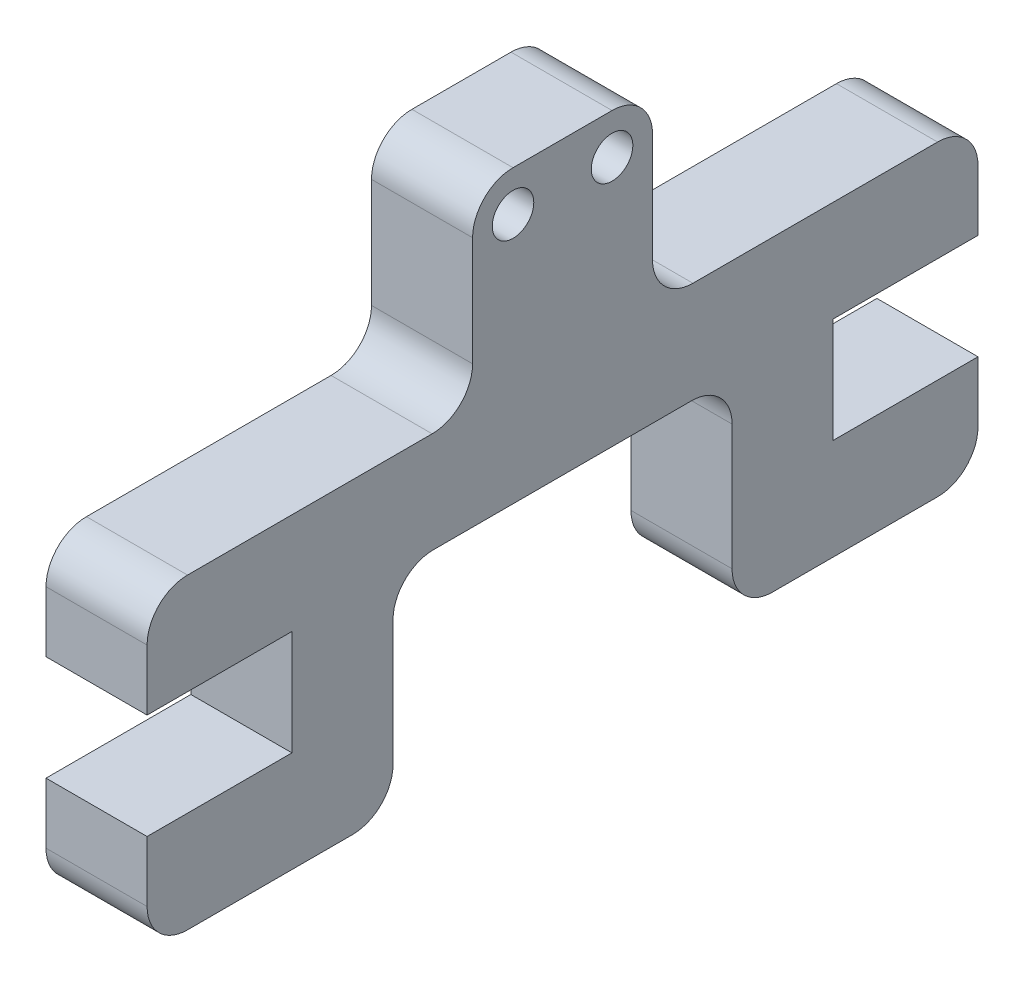
ISO-10303-21;
HEADER;
FILE_DESCRIPTION(('STEP AP214'),'2;1');
FILE_NAME('part.step','',(''),(''),'','','');
FILE_SCHEMA(('AUTOMOTIVE_DESIGN { 1 0 10303 214 1 1 1 1 }'));
ENDSEC;
DATA;
#1=APPLICATION_CONTEXT('core data for automotive mechanical design processes');
#2=APPLICATION_PROTOCOL_DEFINITION('international standard','automotive_design',2000,#1);
#3=PRODUCT_CONTEXT('',#1,'mechanical');
#4=PRODUCT('Part','Part','',(#3));
#5=PRODUCT_RELATED_PRODUCT_CATEGORY('part','',(#4));
#6=PRODUCT_DEFINITION_FORMATION('','',#4);
#7=PRODUCT_DEFINITION_CONTEXT('part definition',#1,'design');
#8=PRODUCT_DEFINITION('design','',#6,#7);
#9=PRODUCT_DEFINITION_SHAPE('','',#8);
#10=(LENGTH_UNIT() NAMED_UNIT(*) SI_UNIT(.MILLI.,.METRE.));
#11=(NAMED_UNIT(*) PLANE_ANGLE_UNIT() SI_UNIT($,.RADIAN.));
#12=(NAMED_UNIT(*) SI_UNIT($,.STERADIAN.) SOLID_ANGLE_UNIT());
#13=UNCERTAINTY_MEASURE_WITH_UNIT(LENGTH_MEASURE(1.E-05),#10,'distance_accuracy_value','');
#14=(GEOMETRIC_REPRESENTATION_CONTEXT(3) GLOBAL_UNCERTAINTY_ASSIGNED_CONTEXT((#13)) GLOBAL_UNIT_ASSIGNED_CONTEXT((#10,
#11,#12)) REPRESENTATION_CONTEXT('',''));
#15=CARTESIAN_POINT('',(0.,0.,0.));
#16=DIRECTION('',(0.,0.,1.));
#17=DIRECTION('',(1.,0.,0.));
#18=AXIS2_PLACEMENT_3D('',#15,#16,#17);
#19=CARTESIAN_POINT('',(10.,-28.8,32.2));
#20=DIRECTION('',(0.,1.,0.));
#21=DIRECTION('',(0.,0.,1.));
#22=AXIS2_PLACEMENT_3D('',#19,#20,#21);
#23=PLANE('',#22);
#24=DIRECTION('',(0.,0.,-1.));
#25=VECTOR('',#24,1.);
#26=CARTESIAN_POINT('',(0.,-28.8,32.2));
#27=LINE('',#26,#25);
#28=CARTESIAN_POINT('',(0.,-28.8,3.87));
#29=VERTEX_POINT('',#28);
#30=CARTESIAN_POINT('',(0.,-28.8,-21.67));
#31=VERTEX_POINT('',#30);
#32=EDGE_CURVE('E421',#29,#31,#27,.T.);
#33=ORIENTED_EDGE('',*,*,#32,.T.);
#34=DIRECTION('',(1.,0.,0.));
#35=VECTOR('',#34,1.);
#36=CARTESIAN_POINT('',(10.,-28.8,-21.67));
#37=LINE('',#36,#35);
#38=CARTESIAN_POINT('',(10.,-28.8,-21.67));
#39=VERTEX_POINT('',#38);
#40=EDGE_CURVE('E525',#31,#39,#37,.T.);
#41=ORIENTED_EDGE('',*,*,#40,.T.);
#42=DIRECTION('',(0.,0.,-1.));
#43=VECTOR('',#42,1.);
#44=CARTESIAN_POINT('',(10.,-28.8,32.2));
#45=LINE('',#44,#43);
#46=CARTESIAN_POINT('',(10.,-28.8,3.87));
#47=VERTEX_POINT('',#46);
#48=EDGE_CURVE('E391',#47,#39,#45,.T.);
#49=ORIENTED_EDGE('',*,*,#48,.F.);
#50=DIRECTION('',(1.,0.,0.));
#51=VECTOR('',#50,1.);
#52=CARTESIAN_POINT('',(10.,-28.8,3.87));
#53=LINE('',#52,#51);
#54=EDGE_CURVE('E522',#47,#29,#53,.F.);
#55=ORIENTED_EDGE('',*,*,#54,.T.);
#56=EDGE_LOOP('',(#33,#41,#49,#55));
#57=FACE_BOUND('',#56,.T.);
#58=ADVANCED_FACE('F38',(#57),#23,.F.);
#59=CARTESIAN_POINT('',(10.,-28.8,-35.67));
#60=VERTEX_POINT('',#59);
#61=CARTESIAN_POINT('',(10.,-28.8,-50.));
#62=VERTEX_POINT('',#61);
#63=EDGE_CURVE('E385',#60,#62,#45,.T.);
#64=ORIENTED_EDGE('',*,*,#63,.F.);
#65=DIRECTION('',(1.,0.,0.));
#66=VECTOR('',#65,1.);
#67=CARTESIAN_POINT('',(-31.7507307002532,-28.8,-35.67));
#68=LINE('',#67,#66);
#69=CARTESIAN_POINT('',(0.,-28.8,-35.67));
#70=VERTEX_POINT('',#69);
#71=EDGE_CURVE('E265',#70,#60,#68,.T.);
#72=ORIENTED_EDGE('',*,*,#71,.F.);
#73=CARTESIAN_POINT('',(0.,-28.8,-50.));
#74=VERTEX_POINT('',#73);
#75=EDGE_CURVE('E415',#70,#74,#27,.T.);
#76=ORIENTED_EDGE('',*,*,#75,.T.);
#77=DIRECTION('',(-1.,0.,0.));
#78=VECTOR('',#77,1.);
#79=CARTESIAN_POINT('',(10.,-28.8,-50.));
#80=LINE('',#79,#78);
#81=EDGE_CURVE('E406',#62,#74,#80,.T.);
#82=ORIENTED_EDGE('',*,*,#81,.F.);
#83=EDGE_LOOP('',(#64,#72,#76,#82));
#84=FACE_BOUND('',#83,.T.);
#85=ADVANCED_FACE('F601',(#84),#23,.F.);
#86=CARTESIAN_POINT('',(10.,0.,0.));
#87=DIRECTION('',(0.,0.,-1.));
#88=DIRECTION('',(0.,1.,0.));
#89=AXIS2_PLACEMENT_3D('',#86,#87,#88);
#90=PLANE('',#89);
#91=DIRECTION('',(0.,-1.,0.));
#92=VECTOR('',#91,1.);
#93=CARTESIAN_POINT('',(0.,0.,0.));
#94=LINE('',#93,#92);
#95=CARTESIAN_POINT('',(0.,-4.,0.));
#96=VERTEX_POINT('',#95);
#97=CARTESIAN_POINT('',(0.,-14.8,0.));
#98=VERTEX_POINT('',#97);
#99=EDGE_CURVE('E361',#96,#98,#94,.T.);
#100=ORIENTED_EDGE('',*,*,#99,.T.);
#101=DIRECTION('',(-1.,0.,0.));
#102=VECTOR('',#101,1.);
#103=CARTESIAN_POINT('',(10.,-14.8,0.));
#104=LINE('',#103,#102);
#105=CARTESIAN_POINT('',(10.,-14.8,0.));
#106=VERTEX_POINT('',#105);
#107=EDGE_CURVE('E572',#98,#106,#104,.F.);
#108=ORIENTED_EDGE('',*,*,#107,.T.);
#109=DIRECTION('',(0.,-1.,0.));
#110=VECTOR('',#109,1.);
#111=CARTESIAN_POINT('',(10.,0.,0.));
#112=LINE('',#111,#110);
#113=CARTESIAN_POINT('',(10.,-4.,0.));
#114=VERTEX_POINT('',#113);
#115=EDGE_CURVE('E373',#114,#106,#112,.T.);
#116=ORIENTED_EDGE('',*,*,#115,.F.);
#117=DIRECTION('',(-1.,0.,0.));
#118=VECTOR('',#117,1.);
#119=CARTESIAN_POINT('',(10.,-4.,0.));
#120=LINE('',#119,#118);
#121=EDGE_CURVE('E466',#114,#96,#120,.T.);
#122=ORIENTED_EDGE('',*,*,#121,.T.);
#123=EDGE_LOOP('',(#100,#108,#116,#122));
#124=FACE_BOUND('',#123,.T.);
#125=ADVANCED_FACE('F643',(#124),#90,.F.);
#126=CARTESIAN_POINT('',(10.,-18.8,0.));
#127=DIRECTION('',(0.,-1.,0.));
#128=DIRECTION('',(0.,0.,-1.));
#129=AXIS2_PLACEMENT_3D('',#126,#127,#128);
#130=PLANE('',#129);
#131=DIRECTION('',(0.,0.,1.));
#132=VECTOR('',#131,1.);
#133=CARTESIAN_POINT('',(0.,-18.8,0.));
#134=LINE('',#133,#132);
#135=CARTESIAN_POINT('',(0.,-18.8,4.));
#136=VERTEX_POINT('',#135);
#137=CARTESIAN_POINT('',(0.,-18.8,28.2));
#138=VERTEX_POINT('',#137);
#139=EDGE_CURVE('E409',#136,#138,#134,.T.);
#140=ORIENTED_EDGE('',*,*,#139,.T.);
#141=DIRECTION('',(-1.,0.,0.));
#142=VECTOR('',#141,1.);
#143=CARTESIAN_POINT('',(10.,-18.8,28.2));
#144=LINE('',#143,#142);
#145=CARTESIAN_POINT('',(10.,-18.8,28.2));
#146=VERTEX_POINT('',#145);
#147=EDGE_CURVE('E565',#138,#146,#144,.F.);
#148=ORIENTED_EDGE('',*,*,#147,.T.);
#149=DIRECTION('',(0.,0.,1.));
#150=VECTOR('',#149,1.);
#151=CARTESIAN_POINT('',(10.,-18.8,0.));
#152=LINE('',#151,#150);
#153=CARTESIAN_POINT('',(10.,-18.8,4.));
#154=VERTEX_POINT('',#153);
#155=EDGE_CURVE('E377',#154,#146,#152,.T.);
#156=ORIENTED_EDGE('',*,*,#155,.F.);
#157=DIRECTION('',(-1.,0.,0.));
#158=VECTOR('',#157,1.);
#159=CARTESIAN_POINT('',(0.,-18.8,4.));
#160=LINE('',#159,#158);
#161=EDGE_CURVE('E561',#154,#136,#160,.T.);
#162=ORIENTED_EDGE('',*,*,#161,.T.);
#163=EDGE_LOOP('',(#140,#148,#156,#162));
#164=FACE_BOUND('',#163,.T.);
#165=ADVANCED_FACE('F650',(#164),#130,.F.);
#166=CARTESIAN_POINT('',(10.,-18.8,32.2));
#167=DIRECTION('',(0.,0.,-1.));
#168=DIRECTION('',(-1.,0.,0.));
#169=AXIS2_PLACEMENT_3D('',#166,#167,#168);
#170=PLANE('',#169);
#171=DIRECTION('',(0.,-1.,0.));
#172=VECTOR('',#171,1.);
#173=CARTESIAN_POINT('',(10.,-18.8,32.2));
#174=LINE('',#173,#172);
#175=CARTESIAN_POINT('',(10.,-22.8,32.2));
#176=VERTEX_POINT('',#175);
#177=CARTESIAN_POINT('',(10.,-28.8,32.2));
#178=VERTEX_POINT('',#177);
#179=EDGE_CURVE('E382',#176,#178,#174,.T.);
#180=ORIENTED_EDGE('',*,*,#179,.F.);
#181=DIRECTION('',(-1.,0.,0.));
#182=VECTOR('',#181,1.);
#183=CARTESIAN_POINT('',(10.,-22.8,32.2));
#184=LINE('',#183,#182);
#185=CARTESIAN_POINT('',(0.,-22.8,32.2));
#186=VERTEX_POINT('',#185);
#187=EDGE_CURVE('E557',#176,#186,#184,.T.);
#188=ORIENTED_EDGE('',*,*,#187,.T.);
#189=DIRECTION('',(0.,-1.,0.));
#190=VECTOR('',#189,1.);
#191=CARTESIAN_POINT('',(0.,-18.8,32.2));
#192=LINE('',#191,#190);
#193=CARTESIAN_POINT('',(0.,-28.8,32.2));
#194=VERTEX_POINT('',#193);
#195=EDGE_CURVE('E412',#186,#194,#192,.T.);
#196=ORIENTED_EDGE('',*,*,#195,.T.);
#197=DIRECTION('',(-1.,0.,0.));
#198=VECTOR('',#197,1.);
#199=CARTESIAN_POINT('',(10.,-28.8,32.2));
#200=LINE('',#199,#198);
#201=EDGE_CURVE('E438',#178,#194,#200,.T.);
#202=ORIENTED_EDGE('',*,*,#201,.F.);
#203=EDGE_LOOP('',(#180,#188,#196,#202));
#204=FACE_BOUND('',#203,.T.);
#205=ADVANCED_FACE('F658',(#204),#170,.F.);
#206=CARTESIAN_POINT('',(0.,-28.8,17.87));
#207=VERTEX_POINT('',#206);
#208=EDGE_CURVE('E416',#194,#207,#27,.T.);
#209=ORIENTED_EDGE('',*,*,#208,.T.);
#210=DIRECTION('',(1.,0.,0.));
#211=VECTOR('',#210,1.);
#212=CARTESIAN_POINT('',(-31.7507307002532,-28.8,17.87));
#213=LINE('',#212,#211);
#214=CARTESIAN_POINT('',(10.,-28.8,17.87));
#215=VERTEX_POINT('',#214);
#216=EDGE_CURVE('E335',#207,#215,#213,.T.);
#217=ORIENTED_EDGE('',*,*,#216,.T.);
#218=EDGE_CURVE('E386',#178,#215,#45,.T.);
#219=ORIENTED_EDGE('',*,*,#218,.F.);
#220=ORIENTED_EDGE('',*,*,#201,.T.);
#221=EDGE_LOOP('',(#209,#217,#219,#220));
#222=FACE_BOUND('',#221,.T.);
#223=ADVANCED_FACE('F662',(#222),#23,.F.);
#224=CARTESIAN_POINT('',(10.,-28.8,-50.));
#225=DIRECTION('',(0.,0.,1.));
#226=DIRECTION('',(1.,0.,0.));
#227=AXIS2_PLACEMENT_3D('',#224,#225,#226);
#228=PLANE('',#227);
#229=DIRECTION('',(0.,1.,0.));
#230=VECTOR('',#229,1.);
#231=CARTESIAN_POINT('',(0.,-28.8,-50.));
#232=LINE('',#231,#230);
#233=CARTESIAN_POINT('',(0.,-22.8,-50.));
#234=VERTEX_POINT('',#233);
#235=EDGE_CURVE('E420',#74,#234,#232,.T.);
#236=ORIENTED_EDGE('',*,*,#235,.T.);
#237=DIRECTION('',(-1.,0.,0.));
#238=VECTOR('',#237,1.);
#239=CARTESIAN_POINT('',(10.,-22.8,-50.));
#240=LINE('',#239,#238);
#241=CARTESIAN_POINT('',(10.,-22.8,-50.));
#242=VERTEX_POINT('',#241);
#243=EDGE_CURVE('E554',#234,#242,#240,.F.);
#244=ORIENTED_EDGE('',*,*,#243,.T.);
#245=DIRECTION('',(0.,1.,0.));
#246=VECTOR('',#245,1.);
#247=CARTESIAN_POINT('',(10.,-28.8,-50.));
#248=LINE('',#247,#246);
#249=EDGE_CURVE('E390',#62,#242,#248,.T.);
#250=ORIENTED_EDGE('',*,*,#249,.F.);
#251=ORIENTED_EDGE('',*,*,#81,.T.);
#252=EDGE_LOOP('',(#236,#244,#250,#251));
#253=FACE_BOUND('',#252,.T.);
#254=ADVANCED_FACE('F605',(#253),#228,.F.);
#255=CARTESIAN_POINT('',(10.,-18.8,-17.8));
#256=DIRECTION('',(0.,-1.,0.));
#257=DIRECTION('',(0.,0.,-1.));
#258=AXIS2_PLACEMENT_3D('',#255,#256,#257);
#259=PLANE('',#258);
#260=DIRECTION('',(0.,0.,1.));
#261=VECTOR('',#260,1.);
#262=CARTESIAN_POINT('',(10.,-18.8,-17.8));
#263=LINE('',#262,#261);
#264=CARTESIAN_POINT('',(10.,-18.8,-46.));
#265=VERTEX_POINT('',#264);
#266=CARTESIAN_POINT('',(10.,-18.8,-21.8));
#267=VERTEX_POINT('',#266);
#268=EDGE_CURVE('E395',#265,#267,#263,.T.);
#269=ORIENTED_EDGE('',*,*,#268,.F.);
#270=DIRECTION('',(-1.,0.,0.));
#271=VECTOR('',#270,1.);
#272=CARTESIAN_POINT('',(10.,-18.8,-46.));
#273=LINE('',#272,#271);
#274=CARTESIAN_POINT('',(0.,-18.8,-46.));
#275=VERTEX_POINT('',#274);
#276=EDGE_CURVE('E550',#265,#275,#273,.T.);
#277=ORIENTED_EDGE('',*,*,#276,.T.);
#278=DIRECTION('',(0.,0.,1.));
#279=VECTOR('',#278,1.);
#280=CARTESIAN_POINT('',(0.,-18.8,-17.8));
#281=LINE('',#280,#279);
#282=CARTESIAN_POINT('',(0.,-18.8,-21.8));
#283=VERTEX_POINT('',#282);
#284=EDGE_CURVE('E425',#275,#283,#281,.T.);
#285=ORIENTED_EDGE('',*,*,#284,.T.);
#286=DIRECTION('',(-1.,0.,0.));
#287=VECTOR('',#286,1.);
#288=CARTESIAN_POINT('',(10.,-18.8,-21.8));
#289=LINE('',#288,#287);
#290=EDGE_CURVE('E547',#283,#267,#289,.F.);
#291=ORIENTED_EDGE('',*,*,#290,.T.);
#292=EDGE_LOOP('',(#269,#277,#285,#291));
#293=FACE_BOUND('',#292,.T.);
#294=ADVANCED_FACE('F616',(#293),#259,.F.);
#295=CARTESIAN_POINT('',(10.,0.,-17.8));
#296=DIRECTION('',(0.,0.,1.));
#297=DIRECTION('',(0.,-1.,0.));
#298=AXIS2_PLACEMENT_3D('',#295,#296,#297);
#299=PLANE('',#298);
#300=DIRECTION('',(0.,1.,0.));
#301=VECTOR('',#300,1.);
#302=CARTESIAN_POINT('',(10.,0.,-17.8));
#303=LINE('',#302,#301);
#304=CARTESIAN_POINT('',(10.,-14.8,-17.8));
#305=VERTEX_POINT('',#304);
#306=CARTESIAN_POINT('',(10.,-4.,-17.8));
#307=VERTEX_POINT('',#306);
#308=EDGE_CURVE('E399',#305,#307,#303,.T.);
#309=ORIENTED_EDGE('',*,*,#308,.F.);
#310=DIRECTION('',(-1.,0.,0.));
#311=VECTOR('',#310,1.);
#312=CARTESIAN_POINT('',(0.,-14.8,-17.8));
#313=LINE('',#312,#311);
#314=CARTESIAN_POINT('',(0.,-14.8,-17.8));
#315=VERTEX_POINT('',#314);
#316=EDGE_CURVE('E568',#305,#315,#313,.T.);
#317=ORIENTED_EDGE('',*,*,#316,.T.);
#318=DIRECTION('',(0.,1.,0.));
#319=VECTOR('',#318,1.);
#320=CARTESIAN_POINT('',(0.,0.,-17.8));
#321=LINE('',#320,#319);
#322=CARTESIAN_POINT('',(0.,-4.,-17.8));
#323=VERTEX_POINT('',#322);
#324=EDGE_CURVE('E429',#315,#323,#321,.T.);
#325=ORIENTED_EDGE('',*,*,#324,.T.);
#326=DIRECTION('',(-1.,0.,0.));
#327=VECTOR('',#326,1.);
#328=CARTESIAN_POINT('',(10.,-4.,-17.8));
#329=LINE('',#328,#327);
#330=EDGE_CURVE('E456',#323,#307,#329,.F.);
#331=ORIENTED_EDGE('',*,*,#330,.T.);
#332=EDGE_LOOP('',(#309,#317,#325,#331));
#333=FACE_BOUND('',#332,.T.);
#334=ADVANCED_FACE('F625',(#333),#299,.F.);
#335=CARTESIAN_POINT('',(10.,0.,0.));
#336=DIRECTION('',(0.,-1.,0.));
#337=DIRECTION('',(0.,0.,-1.));
#338=AXIS2_PLACEMENT_3D('',#335,#336,#337);
#339=PLANE('',#338);
#340=DIRECTION('',(0.,0.,1.));
#341=VECTOR('',#340,1.);
#342=CARTESIAN_POINT('',(10.,0.,0.));
#343=LINE('',#342,#341);
#344=CARTESIAN_POINT('',(10.,0.,-13.8));
#345=VERTEX_POINT('',#344);
#346=CARTESIAN_POINT('',(10.,0.,-4.));
#347=VERTEX_POINT('',#346);
#348=EDGE_CURVE('E402',#345,#347,#343,.T.);
#349=ORIENTED_EDGE('',*,*,#348,.F.);
#350=DIRECTION('',(-1.,0.,0.));
#351=VECTOR('',#350,1.);
#352=CARTESIAN_POINT('',(10.,0.,-13.8));
#353=LINE('',#352,#351);
#354=CARTESIAN_POINT('',(0.,0.,-13.8));
#355=VERTEX_POINT('',#354);
#356=EDGE_CURVE('E445',#345,#355,#353,.T.);
#357=ORIENTED_EDGE('',*,*,#356,.T.);
#358=DIRECTION('',(0.,0.,1.));
#359=VECTOR('',#358,1.);
#360=CARTESIAN_POINT('',(0.,0.,0.));
#361=LINE('',#360,#359);
#362=CARTESIAN_POINT('',(0.,0.,-4.));
#363=VERTEX_POINT('',#362);
#364=EDGE_CURVE('E378',#355,#363,#361,.T.);
#365=ORIENTED_EDGE('',*,*,#364,.T.);
#366=DIRECTION('',(-1.,0.,0.));
#367=VECTOR('',#366,1.);
#368=CARTESIAN_POINT('',(10.,0.,-4.));
#369=LINE('',#368,#367);
#370=EDGE_CURVE('E442',#363,#347,#369,.F.);
#371=ORIENTED_EDGE('',*,*,#370,.T.);
#372=EDGE_LOOP('',(#349,#357,#365,#371));
#373=FACE_BOUND('',#372,.T.);
#374=ADVANCED_FACE('F635',(#373),#339,.F.);
#375=CARTESIAN_POINT('',(10.,0.,0.));
#376=DIRECTION('',(-1.,0.,0.));
#377=DIRECTION('',(0.,0.,1.));
#378=AXIS2_PLACEMENT_3D('',#375,#376,#377);
#379=PLANE('',#378);
#380=CARTESIAN_POINT('',(10.,-4.,-4.));
#381=DIRECTION('',(1.,0.,0.));
#382=DIRECTION('',(0.,0.,-1.));
#383=AXIS2_PLACEMENT_3D('',#380,#381,#382);
#384=CIRCLE('',#383,2.055);
#385=CARTESIAN_POINT('',(10.,-4.,-6.055));
#386=VERTEX_POINT('',#385);
#387=EDGE_CURVE('E362',#386,#386,#384,.T.);
#388=ORIENTED_EDGE('',*,*,#387,.F.);
#389=EDGE_LOOP('',(#388));
#390=FACE_BOUND('',#389,.T.);
#391=CARTESIAN_POINT('',(10.,-4.,-13.8));
#392=DIRECTION('',(1.,0.,0.));
#393=DIRECTION('',(0.,0.,-1.));
#394=AXIS2_PLACEMENT_3D('',#391,#392,#393);
#395=CIRCLE('',#394,2.055);
#396=CARTESIAN_POINT('',(10.,-4.,-15.855));
#397=VERTEX_POINT('',#396);
#398=EDGE_CURVE('E356',#397,#397,#395,.T.);
#399=ORIENTED_EDGE('',*,*,#398,.F.);
#400=EDGE_LOOP('',(#399));
#401=FACE_BOUND('',#400,.T.);
#402=DIRECTION('',(0.,0.,-1.));
#403=VECTOR('',#402,1.);
#404=CARTESIAN_POINT('',(10.,-49.2,-50.));
#405=LINE('',#404,#403);
#406=CARTESIAN_POINT('',(10.,-49.2,-29.67));
#407=VERTEX_POINT('',#406);
#408=CARTESIAN_POINT('',(10.,-49.2,-46.));
#409=VERTEX_POINT('',#408);
#410=EDGE_CURVE('E283',#407,#409,#405,.T.);
#411=ORIENTED_EDGE('',*,*,#410,.T.);
#412=CARTESIAN_POINT('',(10.,-45.2,-46.));
#413=DIRECTION('',(-1.,0.,0.));
#414=DIRECTION('',(0.,0.,1.));
#415=AXIS2_PLACEMENT_3D('',#412,#413,#414);
#416=CIRCLE('',#415,4.);
#417=CARTESIAN_POINT('',(10.,-45.2,-50.));
#418=VERTEX_POINT('',#417);
#419=EDGE_CURVE('E492',#409,#418,#416,.F.);
#420=ORIENTED_EDGE('',*,*,#419,.T.);
#421=DIRECTION('',(0.,1.,0.));
#422=VECTOR('',#421,1.);
#423=CARTESIAN_POINT('',(10.,-39.2,-50.));
#424=LINE('',#423,#422);
#425=CARTESIAN_POINT('',(10.,-39.2,-50.));
#426=VERTEX_POINT('',#425);
#427=EDGE_CURVE('E273',#418,#426,#424,.T.);
#428=ORIENTED_EDGE('',*,*,#427,.T.);
#429=DIRECTION('',(0.,0.,1.));
#430=VECTOR('',#429,1.);
#431=CARTESIAN_POINT('',(10.,-39.2,-35.67));
#432=LINE('',#431,#430);
#433=CARTESIAN_POINT('',(10.,-39.2,-35.67));
#434=VERTEX_POINT('',#433);
#435=EDGE_CURVE('E252',#426,#434,#432,.T.);
#436=ORIENTED_EDGE('',*,*,#435,.T.);
#437=DIRECTION('',(0.,1.,0.));
#438=VECTOR('',#437,1.);
#439=CARTESIAN_POINT('',(10.,-28.8,-35.67));
#440=LINE('',#439,#438);
#441=EDGE_CURVE('E262',#434,#60,#440,.T.);
#442=ORIENTED_EDGE('',*,*,#441,.T.);
#443=ORIENTED_EDGE('',*,*,#63,.T.);
#444=ORIENTED_EDGE('',*,*,#249,.T.);
#445=CARTESIAN_POINT('',(10.,-22.8,-46.));
#446=DIRECTION('',(-1.,0.,0.));
#447=DIRECTION('',(0.,0.,1.));
#448=AXIS2_PLACEMENT_3D('',#445,#446,#447);
#449=CIRCLE('',#448,4.);
#450=EDGE_CURVE('E480',#242,#265,#449,.F.);
#451=ORIENTED_EDGE('',*,*,#450,.T.);
#452=ORIENTED_EDGE('',*,*,#268,.T.);
#453=CARTESIAN_POINT('',(10.,-14.8,-21.8));
#454=DIRECTION('',(-1.,0.,0.));
#455=DIRECTION('',(0.,0.,1.));
#456=AXIS2_PLACEMENT_3D('',#453,#454,#455);
#457=CIRCLE('',#456,4.);
#458=EDGE_CURVE('E590',#267,#305,#457,.T.);
#459=ORIENTED_EDGE('',*,*,#458,.T.);
#460=ORIENTED_EDGE('',*,*,#308,.T.);
#461=CARTESIAN_POINT('',(10.,-4.,-13.8));
#462=DIRECTION('',(-1.,0.,0.));
#463=DIRECTION('',(0.,0.,1.));
#464=AXIS2_PLACEMENT_3D('',#461,#462,#463);
#465=CIRCLE('',#464,4.);
#466=EDGE_CURVE('E463',#307,#345,#465,.F.);
#467=ORIENTED_EDGE('',*,*,#466,.T.);
#468=ORIENTED_EDGE('',*,*,#348,.T.);
#469=CARTESIAN_POINT('',(10.,-4.,-4.));
#470=DIRECTION('',(-1.,0.,0.));
#471=DIRECTION('',(0.,0.,1.));
#472=AXIS2_PLACEMENT_3D('',#469,#470,#471);
#473=CIRCLE('',#472,4.);
#474=EDGE_CURVE('E460',#347,#114,#473,.F.);
#475=ORIENTED_EDGE('',*,*,#474,.T.);
#476=ORIENTED_EDGE('',*,*,#115,.T.);
#477=CARTESIAN_POINT('',(10.,-14.8,4.));
#478=DIRECTION('',(-1.,0.,0.));
#479=DIRECTION('',(0.,0.,1.));
#480=AXIS2_PLACEMENT_3D('',#477,#478,#479);
#481=CIRCLE('',#480,4.);
#482=EDGE_CURVE('E11',#106,#154,#481,.T.);
#483=ORIENTED_EDGE('',*,*,#482,.T.);
#484=ORIENTED_EDGE('',*,*,#155,.T.);
#485=CARTESIAN_POINT('',(10.,-22.8,28.2));
#486=DIRECTION('',(-1.,0.,0.));
#487=DIRECTION('',(0.,0.,1.));
#488=AXIS2_PLACEMENT_3D('',#485,#486,#487);
#489=CIRCLE('',#488,4.);
#490=EDGE_CURVE('E477',#146,#176,#489,.F.);
#491=ORIENTED_EDGE('',*,*,#490,.T.);
#492=ORIENTED_EDGE('',*,*,#179,.T.);
#493=ORIENTED_EDGE('',*,*,#218,.T.);
#494=DIRECTION('',(0.,-1.,0.));
#495=VECTOR('',#494,1.);
#496=CARTESIAN_POINT('',(10.,-28.8,17.87));
#497=LINE('',#496,#495);
#498=CARTESIAN_POINT('',(10.,-39.2,17.87));
#499=VERTEX_POINT('',#498);
#500=EDGE_CURVE('E306',#215,#499,#497,.T.);
#501=ORIENTED_EDGE('',*,*,#500,.T.);
#502=DIRECTION('',(0.,0.,1.));
#503=VECTOR('',#502,1.);
#504=CARTESIAN_POINT('',(10.,-39.2,17.87));
#505=LINE('',#504,#503);
#506=CARTESIAN_POINT('',(10.,-39.2,32.2));
#507=VERTEX_POINT('',#506);
#508=EDGE_CURVE('E320',#499,#507,#505,.T.);
#509=ORIENTED_EDGE('',*,*,#508,.T.);
#510=DIRECTION('',(0.,-1.,0.));
#511=VECTOR('',#510,1.);
#512=CARTESIAN_POINT('',(10.,-39.2,32.2));
#513=LINE('',#512,#511);
#514=CARTESIAN_POINT('',(10.,-45.2,32.2));
#515=VERTEX_POINT('',#514);
#516=EDGE_CURVE('E316',#507,#515,#513,.T.);
#517=ORIENTED_EDGE('',*,*,#516,.T.);
#518=CARTESIAN_POINT('',(10.,-45.2,28.2));
#519=DIRECTION('',(-1.,0.,0.));
#520=DIRECTION('',(0.,0.,1.));
#521=AXIS2_PLACEMENT_3D('',#518,#519,#520);
#522=CIRCLE('',#521,4.);
#523=CARTESIAN_POINT('',(10.,-49.2,28.2));
#524=VERTEX_POINT('',#523);
#525=EDGE_CURVE('E483',#515,#524,#522,.F.);
#526=ORIENTED_EDGE('',*,*,#525,.T.);
#527=DIRECTION('',(0.,0.,-1.));
#528=VECTOR('',#527,1.);
#529=CARTESIAN_POINT('',(10.,-49.2,32.2));
#530=LINE('',#529,#528);
#531=CARTESIAN_POINT('',(10.,-49.2,11.87));
#532=VERTEX_POINT('',#531);
#533=EDGE_CURVE('E312',#524,#532,#530,.T.);
#534=ORIENTED_EDGE('',*,*,#533,.T.);
#535=CARTESIAN_POINT('',(10.,-45.2,11.87));
#536=DIRECTION('',(-1.,0.,0.));
#537=DIRECTION('',(0.,0.,1.));
#538=AXIS2_PLACEMENT_3D('',#535,#536,#537);
#539=CIRCLE('',#538,4.);
#540=CARTESIAN_POINT('',(10.,-45.2,7.87));
#541=VERTEX_POINT('',#540);
#542=EDGE_CURVE('E486',#532,#541,#539,.F.);
#543=ORIENTED_EDGE('',*,*,#542,.T.);
#544=DIRECTION('',(0.,1.,0.));
#545=VECTOR('',#544,1.);
#546=CARTESIAN_POINT('',(10.,-49.2,7.87));
#547=LINE('',#546,#545);
#548=CARTESIAN_POINT('',(10.,-32.8,7.87));
#549=VERTEX_POINT('',#548);
#550=EDGE_CURVE('E307',#541,#549,#547,.T.);
#551=ORIENTED_EDGE('',*,*,#550,.T.);
#552=CARTESIAN_POINT('',(10.,-32.8,3.87));
#553=DIRECTION('',(-1.,0.,0.));
#554=DIRECTION('',(0.,0.,1.));
#555=AXIS2_PLACEMENT_3D('',#552,#553,#554);
#556=CIRCLE('',#555,4.);
#557=EDGE_CURVE('E581',#549,#47,#556,.T.);
#558=ORIENTED_EDGE('',*,*,#557,.T.);
#559=ORIENTED_EDGE('',*,*,#48,.T.);
#560=CARTESIAN_POINT('',(10.,-32.8,-21.67));
#561=DIRECTION('',(-1.,0.,0.));
#562=DIRECTION('',(0.,0.,1.));
#563=AXIS2_PLACEMENT_3D('',#560,#561,#562);
#564=CIRCLE('',#563,4.);
#565=CARTESIAN_POINT('',(10.,-32.8,-25.67));
#566=VERTEX_POINT('',#565);
#567=EDGE_CURVE('E575',#39,#566,#564,.T.);
#568=ORIENTED_EDGE('',*,*,#567,.T.);
#569=DIRECTION('',(0.,-1.,0.));
#570=VECTOR('',#569,1.);
#571=CARTESIAN_POINT('',(10.,-49.2,-25.67));
#572=LINE('',#571,#570);
#573=CARTESIAN_POINT('',(10.,-45.2,-25.67));
#574=VERTEX_POINT('',#573);
#575=EDGE_CURVE('E268',#566,#574,#572,.T.);
#576=ORIENTED_EDGE('',*,*,#575,.T.);
#577=CARTESIAN_POINT('',(10.,-45.2,-29.67));
#578=DIRECTION('',(-1.,0.,0.));
#579=DIRECTION('',(0.,0.,1.));
#580=AXIS2_PLACEMENT_3D('',#577,#578,#579);
#581=CIRCLE('',#580,4.);
#582=EDGE_CURVE('E489',#574,#407,#581,.F.);
#583=ORIENTED_EDGE('',*,*,#582,.T.);
#584=EDGE_LOOP('',(#411,#420,#428,#436,#442,#443,#444,#451,#452,#459,#460,#467,#468,#475,#476,
#483,#484,#491,#492,#493,#501,#509,#517,#526,#534,#543,#551,#558,#559,#568,#576,#583));
#585=FACE_BOUND('',#584,.T.);
#586=ADVANCED_FACE('F271',(#390,#401,#585),#379,.F.);
#587=CARTESIAN_POINT('',(0.,0.,0.));
#588=DIRECTION('',(-1.,0.,0.));
#589=DIRECTION('',(0.,0.,1.));
#590=AXIS2_PLACEMENT_3D('',#587,#588,#589);
#591=PLANE('',#590);
#592=CARTESIAN_POINT('',(0.,-4.,-4.));
#593=DIRECTION('',(1.,0.,0.));
#594=DIRECTION('',(0.,0.,-1.));
#595=AXIS2_PLACEMENT_3D('',#592,#593,#594);
#596=CIRCLE('',#595,2.055);
#597=CARTESIAN_POINT('',(0.,-4.,-6.055));
#598=VERTEX_POINT('',#597);
#599=EDGE_CURVE('E357',#598,#598,#596,.T.);
#600=ORIENTED_EDGE('',*,*,#599,.T.);
#601=EDGE_LOOP('',(#600));
#602=FACE_BOUND('',#601,.T.);
#603=CARTESIAN_POINT('',(0.,-4.,-13.8));
#604=DIRECTION('',(1.,0.,0.));
#605=DIRECTION('',(0.,0.,-1.));
#606=AXIS2_PLACEMENT_3D('',#603,#604,#605);
#607=CIRCLE('',#606,2.055);
#608=CARTESIAN_POINT('',(0.,-4.,-15.855));
#609=VERTEX_POINT('',#608);
#610=EDGE_CURVE('E366',#609,#609,#607,.T.);
#611=ORIENTED_EDGE('',*,*,#610,.T.);
#612=EDGE_LOOP('',(#611));
#613=FACE_BOUND('',#612,.T.);
#614=DIRECTION('',(0.,1.,0.));
#615=VECTOR('',#614,1.);
#616=CARTESIAN_POINT('',(0.,-39.2,-50.));
#617=LINE('',#616,#615);
#618=CARTESIAN_POINT('',(0.,-45.2,-50.));
#619=VERTEX_POINT('',#618);
#620=CARTESIAN_POINT('',(0.,-39.2,-50.));
#621=VERTEX_POINT('',#620);
#622=EDGE_CURVE('E296',#619,#621,#617,.T.);
#623=ORIENTED_EDGE('',*,*,#622,.F.);
#624=CARTESIAN_POINT('',(0.,-45.2,-46.));
#625=DIRECTION('',(-1.,0.,0.));
#626=DIRECTION('',(0.,0.,1.));
#627=AXIS2_PLACEMENT_3D('',#624,#625,#626);
#628=CIRCLE('',#627,4.);
#629=CARTESIAN_POINT('',(0.,-49.2,-46.));
#630=VERTEX_POINT('',#629);
#631=EDGE_CURVE('E512',#619,#630,#628,.T.);
#632=ORIENTED_EDGE('',*,*,#631,.T.);
#633=DIRECTION('',(0.,0.,-1.));
#634=VECTOR('',#633,1.);
#635=CARTESIAN_POINT('',(0.,-49.2,-50.));
#636=LINE('',#635,#634);
#637=CARTESIAN_POINT('',(0.,-49.2,-29.67));
#638=VERTEX_POINT('',#637);
#639=EDGE_CURVE('E281',#638,#630,#636,.T.);
#640=ORIENTED_EDGE('',*,*,#639,.F.);
#641=CARTESIAN_POINT('',(0.,-45.2,-29.67));
#642=DIRECTION('',(-1.,0.,0.));
#643=DIRECTION('',(0.,0.,1.));
#644=AXIS2_PLACEMENT_3D('',#641,#642,#643);
#645=CIRCLE('',#644,4.);
#646=CARTESIAN_POINT('',(0.,-45.2,-25.67));
#647=VERTEX_POINT('',#646);
#648=EDGE_CURVE('E509',#638,#647,#645,.T.);
#649=ORIENTED_EDGE('',*,*,#648,.T.);
#650=DIRECTION('',(0.,-1.,0.));
#651=VECTOR('',#650,1.);
#652=CARTESIAN_POINT('',(0.,-49.2,-25.67));
#653=LINE('',#652,#651);
#654=CARTESIAN_POINT('',(0.,-32.8,-25.67));
#655=VERTEX_POINT('',#654);
#656=EDGE_CURVE('E276',#655,#647,#653,.T.);
#657=ORIENTED_EDGE('',*,*,#656,.F.);
#658=CARTESIAN_POINT('',(0.,-32.8,-21.67));
#659=DIRECTION('',(-1.,0.,0.));
#660=DIRECTION('',(0.,0.,1.));
#661=AXIS2_PLACEMENT_3D('',#658,#659,#660);
#662=CIRCLE('',#661,4.);
#663=EDGE_CURVE('E578',#655,#31,#662,.F.);
#664=ORIENTED_EDGE('',*,*,#663,.T.);
#665=ORIENTED_EDGE('',*,*,#32,.F.);
#666=CARTESIAN_POINT('',(0.,-32.8,3.87));
#667=DIRECTION('',(-1.,0.,0.));
#668=DIRECTION('',(0.,0.,1.));
#669=AXIS2_PLACEMENT_3D('',#666,#667,#668);
#670=CIRCLE('',#669,4.);
#671=CARTESIAN_POINT('',(0.,-32.8,7.87));
#672=VERTEX_POINT('',#671);
#673=EDGE_CURVE('E584',#29,#672,#670,.F.);
#674=ORIENTED_EDGE('',*,*,#673,.T.);
#675=DIRECTION('',(0.,1.,0.));
#676=VECTOR('',#675,1.);
#677=CARTESIAN_POINT('',(0.,-49.2,7.87));
#678=LINE('',#677,#676);
#679=CARTESIAN_POINT('',(0.,-45.2,7.87));
#680=VERTEX_POINT('',#679);
#681=EDGE_CURVE('E331',#680,#672,#678,.T.);
#682=ORIENTED_EDGE('',*,*,#681,.F.);
#683=CARTESIAN_POINT('',(0.,-45.2,11.87));
#684=DIRECTION('',(-1.,0.,0.));
#685=DIRECTION('',(0.,0.,1.));
#686=AXIS2_PLACEMENT_3D('',#683,#684,#685);
#687=CIRCLE('',#686,4.);
#688=CARTESIAN_POINT('',(0.,-49.2,11.87));
#689=VERTEX_POINT('',#688);
#690=EDGE_CURVE('E506',#680,#689,#687,.T.);
#691=ORIENTED_EDGE('',*,*,#690,.T.);
#692=DIRECTION('',(0.,0.,-1.));
#693=VECTOR('',#692,1.);
#694=CARTESIAN_POINT('',(0.,-49.2,32.2));
#695=LINE('',#694,#693);
#696=CARTESIAN_POINT('',(0.,-49.2,28.2));
#697=VERTEX_POINT('',#696);
#698=EDGE_CURVE('E336',#697,#689,#695,.T.);
#699=ORIENTED_EDGE('',*,*,#698,.F.);
#700=CARTESIAN_POINT('',(0.,-45.2,28.2));
#701=DIRECTION('',(-1.,0.,0.));
#702=DIRECTION('',(0.,0.,1.));
#703=AXIS2_PLACEMENT_3D('',#700,#701,#702);
#704=CIRCLE('',#703,4.);
#705=CARTESIAN_POINT('',(0.,-45.2,32.2));
#706=VERTEX_POINT('',#705);
#707=EDGE_CURVE('E503',#697,#706,#704,.T.);
#708=ORIENTED_EDGE('',*,*,#707,.T.);
#709=DIRECTION('',(0.,-1.,0.));
#710=VECTOR('',#709,1.);
#711=CARTESIAN_POINT('',(0.,-39.2,32.2));
#712=LINE('',#711,#710);
#713=CARTESIAN_POINT('',(0.,-39.2,32.2));
#714=VERTEX_POINT('',#713);
#715=EDGE_CURVE('E340',#714,#706,#712,.T.);
#716=ORIENTED_EDGE('',*,*,#715,.F.);
#717=DIRECTION('',(0.,0.,1.));
#718=VECTOR('',#717,1.);
#719=CARTESIAN_POINT('',(0.,-39.2,17.87));
#720=LINE('',#719,#718);
#721=CARTESIAN_POINT('',(0.,-39.2,17.87));
#722=VERTEX_POINT('',#721);
#723=EDGE_CURVE('E345',#722,#714,#720,.T.);
#724=ORIENTED_EDGE('',*,*,#723,.F.);
#725=DIRECTION('',(0.,-1.,0.));
#726=VECTOR('',#725,1.);
#727=CARTESIAN_POINT('',(0.,-28.8,17.87));
#728=LINE('',#727,#726);
#729=EDGE_CURVE('E311',#207,#722,#728,.T.);
#730=ORIENTED_EDGE('',*,*,#729,.F.);
#731=ORIENTED_EDGE('',*,*,#208,.F.);
#732=ORIENTED_EDGE('',*,*,#195,.F.);
#733=CARTESIAN_POINT('',(0.,-22.8,28.2));
#734=DIRECTION('',(-1.,0.,0.));
#735=DIRECTION('',(0.,0.,1.));
#736=AXIS2_PLACEMENT_3D('',#733,#734,#735);
#737=CIRCLE('',#736,4.);
#738=EDGE_CURVE('E59',#186,#138,#737,.T.);
#739=ORIENTED_EDGE('',*,*,#738,.T.);
#740=ORIENTED_EDGE('',*,*,#139,.F.);
#741=CARTESIAN_POINT('',(0.,-14.8,4.));
#742=DIRECTION('',(-1.,0.,0.));
#743=DIRECTION('',(0.,0.,1.));
#744=AXIS2_PLACEMENT_3D('',#741,#742,#743);
#745=CIRCLE('',#744,4.);
#746=EDGE_CURVE('E47',#136,#98,#745,.F.);
#747=ORIENTED_EDGE('',*,*,#746,.T.);
#748=ORIENTED_EDGE('',*,*,#99,.F.);
#749=CARTESIAN_POINT('',(0.,-4.,-4.));
#750=DIRECTION('',(-1.,0.,0.));
#751=DIRECTION('',(0.,0.,1.));
#752=AXIS2_PLACEMENT_3D('',#749,#750,#751);
#753=CIRCLE('',#752,4.);
#754=EDGE_CURVE('E449',#96,#363,#753,.T.);
#755=ORIENTED_EDGE('',*,*,#754,.T.);
#756=ORIENTED_EDGE('',*,*,#364,.F.);
#757=CARTESIAN_POINT('',(0.,-4.,-13.8));
#758=DIRECTION('',(-1.,0.,0.));
#759=DIRECTION('',(0.,0.,1.));
#760=AXIS2_PLACEMENT_3D('',#757,#758,#759);
#761=CIRCLE('',#760,4.);
#762=EDGE_CURVE('E452',#355,#323,#761,.T.);
#763=ORIENTED_EDGE('',*,*,#762,.T.);
#764=ORIENTED_EDGE('',*,*,#324,.F.);
#765=CARTESIAN_POINT('',(0.,-14.8,-21.8));
#766=DIRECTION('',(-1.,0.,0.));
#767=DIRECTION('',(0.,0.,1.));
#768=AXIS2_PLACEMENT_3D('',#765,#766,#767);
#769=CIRCLE('',#768,4.);
#770=EDGE_CURVE('E587',#315,#283,#769,.F.);
#771=ORIENTED_EDGE('',*,*,#770,.T.);
#772=ORIENTED_EDGE('',*,*,#284,.F.);
#773=CARTESIAN_POINT('',(0.,-22.8,-46.));
#774=DIRECTION('',(-1.,0.,0.));
#775=DIRECTION('',(0.,0.,1.));
#776=AXIS2_PLACEMENT_3D('',#773,#774,#775);
#777=CIRCLE('',#776,4.);
#778=EDGE_CURVE('E500',#275,#234,#777,.T.);
#779=ORIENTED_EDGE('',*,*,#778,.T.);
#780=ORIENTED_EDGE('',*,*,#235,.F.);
#781=ORIENTED_EDGE('',*,*,#75,.F.);
#782=DIRECTION('',(0.,1.,0.));
#783=VECTOR('',#782,1.);
#784=CARTESIAN_POINT('',(0.,-28.8,-35.67));
#785=LINE('',#784,#783);
#786=CARTESIAN_POINT('',(0.,-39.2,-35.67));
#787=VERTEX_POINT('',#786);
#788=EDGE_CURVE('E258',#787,#70,#785,.T.);
#789=ORIENTED_EDGE('',*,*,#788,.F.);
#790=DIRECTION('',(0.,0.,1.));
#791=VECTOR('',#790,1.);
#792=CARTESIAN_POINT('',(0.,-39.2,-35.67));
#793=LINE('',#792,#791);
#794=EDGE_CURVE('E254',#621,#787,#793,.T.);
#795=ORIENTED_EDGE('',*,*,#794,.F.);
#796=EDGE_LOOP('',(#623,#632,#640,#649,#657,#664,#665,#674,#682,#691,#699,#708,#716,#724,#730,
#731,#732,#739,#740,#747,#748,#755,#756,#763,#764,#771,#772,#779,#780,#781,#789,#795));
#797=FACE_BOUND('',#796,.T.);
#798=ADVANCED_FACE('F608',(#602,#613,#797),#591,.T.);
#799=CARTESIAN_POINT('',(0.,-4.,-13.8));
#800=DIRECTION('',(1.,0.,0.));
#801=DIRECTION('',(0.,0.,-1.));
#802=AXIS2_PLACEMENT_3D('',#799,#800,#801);
#803=CYLINDRICAL_SURFACE('',#802,2.055);
#804=ORIENTED_EDGE('',*,*,#610,.F.);
#805=EDGE_LOOP('',(#804));
#806=FACE_BOUND('',#805,.T.);
#807=ORIENTED_EDGE('',*,*,#398,.T.);
#808=EDGE_LOOP('',(#807));
#809=FACE_BOUND('',#808,.T.);
#810=ADVANCED_FACE('F884',(#806,#809),#803,.F.);
#811=CARTESIAN_POINT('',(0.,-4.,-4.));
#812=DIRECTION('',(1.,0.,0.));
#813=DIRECTION('',(0.,0.,-1.));
#814=AXIS2_PLACEMENT_3D('',#811,#812,#813);
#815=CYLINDRICAL_SURFACE('',#814,2.055);
#816=ORIENTED_EDGE('',*,*,#599,.F.);
#817=EDGE_LOOP('',(#816));
#818=FACE_BOUND('',#817,.T.);
#819=ORIENTED_EDGE('',*,*,#387,.T.);
#820=EDGE_LOOP('',(#819));
#821=FACE_BOUND('',#820,.T.);
#822=ADVANCED_FACE('F988',(#818,#821),#815,.F.);
#823=CARTESIAN_POINT('',(-31.7507307002532,-28.8,17.87));
#824=DIRECTION('',(0.,0.,1.));
#825=DIRECTION('',(1.,0.,0.));
#826=AXIS2_PLACEMENT_3D('',#823,#824,#825);
#827=PLANE('',#826);
#828=ORIENTED_EDGE('',*,*,#216,.F.);
#829=ORIENTED_EDGE('',*,*,#729,.T.);
#830=DIRECTION('',(1.,0.,0.));
#831=VECTOR('',#830,1.);
#832=CARTESIAN_POINT('',(-31.7507307002532,-39.2,17.87));
#833=LINE('',#832,#831);
#834=EDGE_CURVE('E330',#722,#499,#833,.T.);
#835=ORIENTED_EDGE('',*,*,#834,.T.);
#836=ORIENTED_EDGE('',*,*,#500,.F.);
#837=EDGE_LOOP('',(#828,#829,#835,#836));
#838=FACE_BOUND('',#837,.T.);
#839=ADVANCED_FACE('F666',(#838),#827,.T.);
#840=CARTESIAN_POINT('',(-31.7507307002532,-39.2,17.87));
#841=DIRECTION('',(0.,1.,0.));
#842=DIRECTION('',(0.,0.,1.));
#843=AXIS2_PLACEMENT_3D('',#840,#841,#842);
#844=PLANE('',#843);
#845=ORIENTED_EDGE('',*,*,#834,.F.);
#846=ORIENTED_EDGE('',*,*,#723,.T.);
#847=DIRECTION('',(1.,0.,0.));
#848=VECTOR('',#847,1.);
#849=CARTESIAN_POINT('',(-31.7507307002532,-39.2,32.2));
#850=LINE('',#849,#848);
#851=EDGE_CURVE('E344',#714,#507,#850,.T.);
#852=ORIENTED_EDGE('',*,*,#851,.T.);
#853=ORIENTED_EDGE('',*,*,#508,.F.);
#854=EDGE_LOOP('',(#845,#846,#852,#853));
#855=FACE_BOUND('',#854,.T.);
#856=ADVANCED_FACE('F669',(#855),#844,.T.);
#857=CARTESIAN_POINT('',(-31.7507307002532,-39.2,32.2));
#858=DIRECTION('',(0.,0.,1.));
#859=DIRECTION('',(0.,-1.,0.));
#860=AXIS2_PLACEMENT_3D('',#857,#858,#859);
#861=PLANE('',#860);
#862=ORIENTED_EDGE('',*,*,#715,.T.);
#863=DIRECTION('',(1.,0.,0.));
#864=VECTOR('',#863,1.);
#865=CARTESIAN_POINT('',(-31.7507307002532,-45.2,32.2));
#866=LINE('',#865,#864);
#867=EDGE_CURVE('E543',#706,#515,#866,.T.);
#868=ORIENTED_EDGE('',*,*,#867,.T.);
#869=ORIENTED_EDGE('',*,*,#516,.F.);
#870=ORIENTED_EDGE('',*,*,#851,.F.);
#871=EDGE_LOOP('',(#862,#868,#869,#870));
#872=FACE_BOUND('',#871,.T.);
#873=ADVANCED_FACE('F673',(#872),#861,.T.);
#874=CARTESIAN_POINT('',(-31.7507307002532,-49.2,32.2));
#875=DIRECTION('',(0.,-1.,0.));
#876=DIRECTION('',(0.,0.,-1.));
#877=AXIS2_PLACEMENT_3D('',#874,#875,#876);
#878=PLANE('',#877);
#879=ORIENTED_EDGE('',*,*,#698,.T.);
#880=DIRECTION('',(1.,0.,0.));
#881=VECTOR('',#880,1.);
#882=CARTESIAN_POINT('',(-31.7507307002532,-49.2,11.87));
#883=LINE('',#882,#881);
#884=EDGE_CURVE('E539',#689,#532,#883,.T.);
#885=ORIENTED_EDGE('',*,*,#884,.T.);
#886=ORIENTED_EDGE('',*,*,#533,.F.);
#887=DIRECTION('',(1.,0.,0.));
#888=VECTOR('',#887,1.);
#889=CARTESIAN_POINT('',(-31.7507307002532,-49.2,28.2));
#890=LINE('',#889,#888);
#891=EDGE_CURVE('E536',#524,#697,#890,.F.);
#892=ORIENTED_EDGE('',*,*,#891,.T.);
#893=EDGE_LOOP('',(#879,#885,#886,#892));
#894=FACE_BOUND('',#893,.T.);
#895=ADVANCED_FACE('F679',(#894),#878,.T.);
#896=CARTESIAN_POINT('',(-31.7507307002532,-49.2,7.87));
#897=DIRECTION('',(0.,0.,-1.));
#898=DIRECTION('',(0.,1.,0.));
#899=AXIS2_PLACEMENT_3D('',#896,#897,#898);
#900=PLANE('',#899);
#901=ORIENTED_EDGE('',*,*,#681,.T.);
#902=DIRECTION('',(1.,0.,0.));
#903=VECTOR('',#902,1.);
#904=CARTESIAN_POINT('',(-31.7507307002532,-32.8,7.87));
#905=LINE('',#904,#903);
#906=EDGE_CURVE('E532',#672,#549,#905,.T.);
#907=ORIENTED_EDGE('',*,*,#906,.T.);
#908=ORIENTED_EDGE('',*,*,#550,.F.);
#909=DIRECTION('',(1.,0.,0.));
#910=VECTOR('',#909,1.);
#911=CARTESIAN_POINT('',(-31.7507307002532,-45.2,7.87));
#912=LINE('',#911,#910);
#913=EDGE_CURVE('E529',#541,#680,#912,.F.);
#914=ORIENTED_EDGE('',*,*,#913,.T.);
#915=EDGE_LOOP('',(#901,#907,#908,#914));
#916=FACE_BOUND('',#915,.T.);
#917=ADVANCED_FACE('F691',(#916),#900,.T.);
#918=CARTESIAN_POINT('',(-31.7507307002532,-49.2,-25.67));
#919=DIRECTION('',(0.,0.,1.));
#920=DIRECTION('',(0.,-1.,0.));
#921=AXIS2_PLACEMENT_3D('',#918,#919,#920);
#922=PLANE('',#921);
#923=ORIENTED_EDGE('',*,*,#656,.T.);
#924=DIRECTION('',(1.,0.,0.));
#925=VECTOR('',#924,1.);
#926=CARTESIAN_POINT('',(-31.7507307002532,-45.2,-25.67));
#927=LINE('',#926,#925);
#928=EDGE_CURVE('E518',#647,#574,#927,.T.);
#929=ORIENTED_EDGE('',*,*,#928,.T.);
#930=ORIENTED_EDGE('',*,*,#575,.F.);
#931=DIRECTION('',(1.,0.,0.));
#932=VECTOR('',#931,1.);
#933=CARTESIAN_POINT('',(-31.7507307002532,-32.8,-25.67));
#934=LINE('',#933,#932);
#935=EDGE_CURVE('E515',#566,#655,#934,.F.);
#936=ORIENTED_EDGE('',*,*,#935,.T.);
#937=EDGE_LOOP('',(#923,#929,#930,#936));
#938=FACE_BOUND('',#937,.T.);
#939=ADVANCED_FACE('F707',(#938),#922,.T.);
#940=CARTESIAN_POINT('',(-31.7507307002532,-49.2,-50.));
#941=DIRECTION('',(0.,-1.,0.));
#942=DIRECTION('',(0.,0.,-1.));
#943=AXIS2_PLACEMENT_3D('',#940,#941,#942);
#944=PLANE('',#943);
#945=ORIENTED_EDGE('',*,*,#639,.T.);
#946=DIRECTION('',(1.,0.,0.));
#947=VECTOR('',#946,1.);
#948=CARTESIAN_POINT('',(-31.7507307002532,-49.2,-46.));
#949=LINE('',#948,#947);
#950=EDGE_CURVE('E473',#630,#409,#949,.T.);
#951=ORIENTED_EDGE('',*,*,#950,.T.);
#952=ORIENTED_EDGE('',*,*,#410,.F.);
#953=DIRECTION('',(1.,0.,0.));
#954=VECTOR('',#953,1.);
#955=CARTESIAN_POINT('',(-31.7507307002532,-49.2,-29.67));
#956=LINE('',#955,#954);
#957=EDGE_CURVE('E470',#407,#638,#956,.F.);
#958=ORIENTED_EDGE('',*,*,#957,.T.);
#959=EDGE_LOOP('',(#945,#951,#952,#958));
#960=FACE_BOUND('',#959,.T.);
#961=ADVANCED_FACE('F716',(#960),#944,.T.);
#962=CARTESIAN_POINT('',(-31.7507307002532,-39.2,-50.));
#963=DIRECTION('',(0.,0.,-1.));
#964=DIRECTION('',(0.,1.,0.));
#965=AXIS2_PLACEMENT_3D('',#962,#963,#964);
#966=PLANE('',#965);
#967=ORIENTED_EDGE('',*,*,#427,.F.);
#968=DIRECTION('',(1.,0.,0.));
#969=VECTOR('',#968,1.);
#970=CARTESIAN_POINT('',(-31.7507307002532,-45.2,-50.));
#971=LINE('',#970,#969);
#972=EDGE_CURVE('E495',#418,#619,#971,.F.);
#973=ORIENTED_EDGE('',*,*,#972,.T.);
#974=ORIENTED_EDGE('',*,*,#622,.T.);
#975=DIRECTION('',(1.,0.,0.));
#976=VECTOR('',#975,1.);
#977=CARTESIAN_POINT('',(-31.7507307002532,-39.2,-50.));
#978=LINE('',#977,#976);
#979=EDGE_CURVE('E295',#621,#426,#978,.T.);
#980=ORIENTED_EDGE('',*,*,#979,.T.);
#981=EDGE_LOOP('',(#967,#973,#974,#980));
#982=FACE_BOUND('',#981,.T.);
#983=ADVANCED_FACE('F724',(#982),#966,.T.);
#984=CARTESIAN_POINT('',(-31.7507307002532,-39.2,-35.67));
#985=DIRECTION('',(0.,1.,0.));
#986=DIRECTION('',(0.,0.,1.));
#987=AXIS2_PLACEMENT_3D('',#984,#985,#986);
#988=PLANE('',#987);
#989=ORIENTED_EDGE('',*,*,#979,.F.);
#990=ORIENTED_EDGE('',*,*,#794,.T.);
#991=DIRECTION('',(1.,0.,0.));
#992=VECTOR('',#991,1.);
#993=CARTESIAN_POINT('',(-31.7507307002532,-39.2,-35.67));
#994=LINE('',#993,#992);
#995=EDGE_CURVE('E247',#787,#434,#994,.T.);
#996=ORIENTED_EDGE('',*,*,#995,.T.);
#997=ORIENTED_EDGE('',*,*,#435,.F.);
#998=EDGE_LOOP('',(#989,#990,#996,#997));
#999=FACE_BOUND('',#998,.T.);
#1000=ADVANCED_FACE('F250',(#999),#988,.T.);
#1001=CARTESIAN_POINT('',(-31.7507307002532,-28.8,-35.67));
#1002=DIRECTION('',(0.,0.,-1.));
#1003=DIRECTION('',(-1.,0.,0.));
#1004=AXIS2_PLACEMENT_3D('',#1001,#1002,#1003);
#1005=PLANE('',#1004);
#1006=ORIENTED_EDGE('',*,*,#995,.F.);
#1007=ORIENTED_EDGE('',*,*,#788,.T.);
#1008=ORIENTED_EDGE('',*,*,#71,.T.);
#1009=ORIENTED_EDGE('',*,*,#441,.F.);
#1010=EDGE_LOOP('',(#1006,#1007,#1008,#1009));
#1011=FACE_BOUND('',#1010,.T.);
#1012=ADVANCED_FACE('F263',(#1011),#1005,.T.);
#1013=CARTESIAN_POINT('',(10.,-4.,-13.8));
#1014=DIRECTION('',(-1.,0.,0.));
#1015=DIRECTION('',(0.,0.,1.));
#1016=AXIS2_PLACEMENT_3D('',#1013,#1014,#1015);
#1017=CYLINDRICAL_SURFACE('',#1016,4.);
#1018=ORIENTED_EDGE('',*,*,#466,.F.);
#1019=ORIENTED_EDGE('',*,*,#330,.F.);
#1020=ORIENTED_EDGE('',*,*,#762,.F.);
#1021=ORIENTED_EDGE('',*,*,#356,.F.);
#1022=EDGE_LOOP('',(#1018,#1019,#1020,#1021));
#1023=FACE_BOUND('',#1022,.T.);
#1024=ADVANCED_FACE('F631',(#1023),#1017,.T.);
#1025=CARTESIAN_POINT('',(10.,-4.,-4.));
#1026=DIRECTION('',(-1.,0.,0.));
#1027=DIRECTION('',(0.,0.,1.));
#1028=AXIS2_PLACEMENT_3D('',#1025,#1026,#1027);
#1029=CYLINDRICAL_SURFACE('',#1028,4.);
#1030=ORIENTED_EDGE('',*,*,#474,.F.);
#1031=ORIENTED_EDGE('',*,*,#370,.F.);
#1032=ORIENTED_EDGE('',*,*,#754,.F.);
#1033=ORIENTED_EDGE('',*,*,#121,.F.);
#1034=EDGE_LOOP('',(#1030,#1031,#1032,#1033));
#1035=FACE_BOUND('',#1034,.T.);
#1036=ADVANCED_FACE('F638',(#1035),#1029,.T.);
#1037=CARTESIAN_POINT('',(-31.7507307002532,-45.2,-46.));
#1038=DIRECTION('',(1.,0.,0.));
#1039=DIRECTION('',(0.,0.,-1.));
#1040=AXIS2_PLACEMENT_3D('',#1037,#1038,#1039);
#1041=CYLINDRICAL_SURFACE('',#1040,4.);
#1042=ORIENTED_EDGE('',*,*,#631,.F.);
#1043=ORIENTED_EDGE('',*,*,#972,.F.);
#1044=ORIENTED_EDGE('',*,*,#419,.F.);
#1045=ORIENTED_EDGE('',*,*,#950,.F.);
#1046=EDGE_LOOP('',(#1042,#1043,#1044,#1045));
#1047=FACE_BOUND('',#1046,.T.);
#1048=ADVANCED_FACE('F721',(#1047),#1041,.T.);
#1049=CARTESIAN_POINT('',(-31.7507307002532,-45.2,-29.67));
#1050=DIRECTION('',(1.,0.,0.));
#1051=DIRECTION('',(0.,0.,-1.));
#1052=AXIS2_PLACEMENT_3D('',#1049,#1050,#1051);
#1053=CYLINDRICAL_SURFACE('',#1052,4.);
#1054=ORIENTED_EDGE('',*,*,#648,.F.);
#1055=ORIENTED_EDGE('',*,*,#957,.F.);
#1056=ORIENTED_EDGE('',*,*,#582,.F.);
#1057=ORIENTED_EDGE('',*,*,#928,.F.);
#1058=EDGE_LOOP('',(#1054,#1055,#1056,#1057));
#1059=FACE_BOUND('',#1058,.T.);
#1060=ADVANCED_FACE('F712',(#1059),#1053,.T.);
#1061=CARTESIAN_POINT('',(10.,-32.8,-21.67));
#1062=DIRECTION('',(1.,0.,0.));
#1063=DIRECTION('',(0.,0.,-1.));
#1064=AXIS2_PLACEMENT_3D('',#1061,#1062,#1063);
#1065=CYLINDRICAL_SURFACE('',#1064,4.);
#1066=ORIENTED_EDGE('',*,*,#663,.F.);
#1067=ORIENTED_EDGE('',*,*,#935,.F.);
#1068=ORIENTED_EDGE('',*,*,#567,.F.);
#1069=ORIENTED_EDGE('',*,*,#40,.F.);
#1070=EDGE_LOOP('',(#1066,#1067,#1068,#1069));
#1071=FACE_BOUND('',#1070,.T.);
#1072=ADVANCED_FACE('F703',(#1071),#1065,.F.);
#1073=CARTESIAN_POINT('',(-31.7507307002532,-32.8,3.87));
#1074=DIRECTION('',(1.,0.,0.));
#1075=DIRECTION('',(0.,0.,-1.));
#1076=AXIS2_PLACEMENT_3D('',#1073,#1074,#1075);
#1077=CYLINDRICAL_SURFACE('',#1076,4.);
#1078=ORIENTED_EDGE('',*,*,#673,.F.);
#1079=ORIENTED_EDGE('',*,*,#54,.F.);
#1080=ORIENTED_EDGE('',*,*,#557,.F.);
#1081=ORIENTED_EDGE('',*,*,#906,.F.);
#1082=EDGE_LOOP('',(#1078,#1079,#1080,#1081));
#1083=FACE_BOUND('',#1082,.T.);
#1084=ADVANCED_FACE('F695',(#1083),#1077,.F.);
#1085=CARTESIAN_POINT('',(-31.7507307002532,-45.2,11.87));
#1086=DIRECTION('',(1.,0.,0.));
#1087=DIRECTION('',(0.,0.,-1.));
#1088=AXIS2_PLACEMENT_3D('',#1085,#1086,#1087);
#1089=CYLINDRICAL_SURFACE('',#1088,4.);
#1090=ORIENTED_EDGE('',*,*,#690,.F.);
#1091=ORIENTED_EDGE('',*,*,#913,.F.);
#1092=ORIENTED_EDGE('',*,*,#542,.F.);
#1093=ORIENTED_EDGE('',*,*,#884,.F.);
#1094=EDGE_LOOP('',(#1090,#1091,#1092,#1093));
#1095=FACE_BOUND('',#1094,.T.);
#1096=ADVANCED_FACE('F687',(#1095),#1089,.T.);
#1097=CARTESIAN_POINT('',(-31.7507307002532,-45.2,28.2));
#1098=DIRECTION('',(1.,0.,0.));
#1099=DIRECTION('',(0.,0.,-1.));
#1100=AXIS2_PLACEMENT_3D('',#1097,#1098,#1099);
#1101=CYLINDRICAL_SURFACE('',#1100,4.);
#1102=ORIENTED_EDGE('',*,*,#707,.F.);
#1103=ORIENTED_EDGE('',*,*,#891,.F.);
#1104=ORIENTED_EDGE('',*,*,#525,.F.);
#1105=ORIENTED_EDGE('',*,*,#867,.F.);
#1106=EDGE_LOOP('',(#1102,#1103,#1104,#1105));
#1107=FACE_BOUND('',#1106,.T.);
#1108=ADVANCED_FACE('F683',(#1107),#1101,.T.);
#1109=CARTESIAN_POINT('',(10.,-22.8,-46.));
#1110=DIRECTION('',(-1.,0.,0.));
#1111=DIRECTION('',(0.,0.,1.));
#1112=AXIS2_PLACEMENT_3D('',#1109,#1110,#1111);
#1113=CYLINDRICAL_SURFACE('',#1112,4.);
#1114=ORIENTED_EDGE('',*,*,#450,.F.);
#1115=ORIENTED_EDGE('',*,*,#243,.F.);
#1116=ORIENTED_EDGE('',*,*,#778,.F.);
#1117=ORIENTED_EDGE('',*,*,#276,.F.);
#1118=EDGE_LOOP('',(#1114,#1115,#1116,#1117));
#1119=FACE_BOUND('',#1118,.T.);
#1120=ADVANCED_FACE('F613',(#1119),#1113,.T.);
#1121=CARTESIAN_POINT('',(10.,-22.8,28.2));
#1122=DIRECTION('',(-1.,0.,0.));
#1123=DIRECTION('',(0.,0.,1.));
#1124=AXIS2_PLACEMENT_3D('',#1121,#1122,#1123);
#1125=CYLINDRICAL_SURFACE('',#1124,4.);
#1126=ORIENTED_EDGE('',*,*,#490,.F.);
#1127=ORIENTED_EDGE('',*,*,#147,.F.);
#1128=ORIENTED_EDGE('',*,*,#738,.F.);
#1129=ORIENTED_EDGE('',*,*,#187,.F.);
#1130=EDGE_LOOP('',(#1126,#1127,#1128,#1129));
#1131=FACE_BOUND('',#1130,.T.);
#1132=ADVANCED_FACE('F653',(#1131),#1125,.T.);
#1133=CARTESIAN_POINT('',(10.,-14.8,-21.8));
#1134=DIRECTION('',(1.,0.,0.));
#1135=DIRECTION('',(0.,0.,-1.));
#1136=AXIS2_PLACEMENT_3D('',#1133,#1134,#1135);
#1137=CYLINDRICAL_SURFACE('',#1136,4.);
#1138=ORIENTED_EDGE('',*,*,#458,.F.);
#1139=ORIENTED_EDGE('',*,*,#290,.F.);
#1140=ORIENTED_EDGE('',*,*,#770,.F.);
#1141=ORIENTED_EDGE('',*,*,#316,.F.);
#1142=EDGE_LOOP('',(#1138,#1139,#1140,#1141));
#1143=FACE_BOUND('',#1142,.T.);
#1144=ADVANCED_FACE('F622',(#1143),#1137,.F.);
#1145=CARTESIAN_POINT('',(10.,-14.8,4.));
#1146=DIRECTION('',(1.,0.,0.));
#1147=DIRECTION('',(0.,0.,-1.));
#1148=AXIS2_PLACEMENT_3D('',#1145,#1146,#1147);
#1149=CYLINDRICAL_SURFACE('',#1148,4.);
#1150=ORIENTED_EDGE('',*,*,#482,.F.);
#1151=ORIENTED_EDGE('',*,*,#107,.F.);
#1152=ORIENTED_EDGE('',*,*,#746,.F.);
#1153=ORIENTED_EDGE('',*,*,#161,.F.);
#1154=EDGE_LOOP('',(#1150,#1151,#1152,#1153));
#1155=FACE_BOUND('',#1154,.T.);
#1156=ADVANCED_FACE('F40',(#1155),#1149,.F.);
#1157=CLOSED_SHELL('',(#58,#85,#125,#165,#205,#223,#254,#294,#334,#374,#586,#798,#810,#822,#839,
#856,#873,#895,#917,#939,#961,#983,#1000,#1012,#1024,#1036,#1048,#1060,#1072,#1084,#1096,#1108,
#1120,#1132,#1144,#1156));
#1158=MANIFOLD_SOLID_BREP('B2',#1157);
#1159=ADVANCED_BREP_SHAPE_REPRESENTATION('',(#18,#1158),#14);
#1160=SHAPE_DEFINITION_REPRESENTATION(#9,#1159);
ENDSEC;
END-ISO-10303-21;
